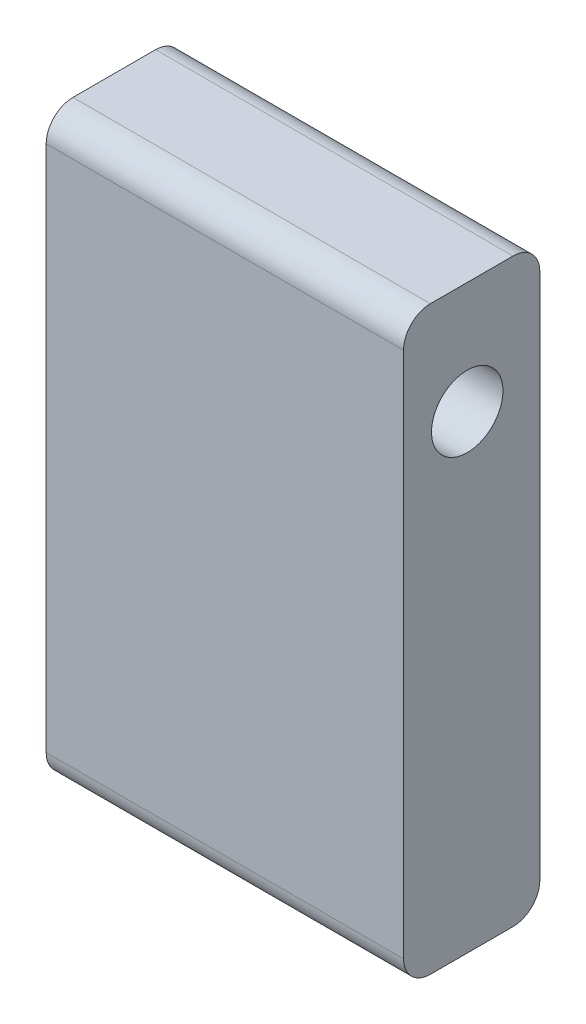
ISO-10303-21;
HEADER;
FILE_DESCRIPTION(('STEP AP214'),'2;1');
FILE_NAME('part.step','',(''),(''),'','','');
FILE_SCHEMA(('AUTOMOTIVE_DESIGN { 1 0 10303 214 1 1 1 1 }'));
ENDSEC;
DATA;
#1=APPLICATION_CONTEXT('core data for automotive mechanical design processes');
#2=APPLICATION_PROTOCOL_DEFINITION('international standard','automotive_design',2000,#1);
#3=PRODUCT_CONTEXT('',#1,'mechanical');
#4=PRODUCT('Part','Part','',(#3));
#5=PRODUCT_RELATED_PRODUCT_CATEGORY('part','',(#4));
#6=PRODUCT_DEFINITION_FORMATION('','',#4);
#7=PRODUCT_DEFINITION_CONTEXT('part definition',#1,'design');
#8=PRODUCT_DEFINITION('design','',#6,#7);
#9=PRODUCT_DEFINITION_SHAPE('','',#8);
#10=(LENGTH_UNIT() NAMED_UNIT(*) SI_UNIT(.MILLI.,.METRE.));
#11=(NAMED_UNIT(*) PLANE_ANGLE_UNIT() SI_UNIT($,.RADIAN.));
#12=(NAMED_UNIT(*) SI_UNIT($,.STERADIAN.) SOLID_ANGLE_UNIT());
#13=UNCERTAINTY_MEASURE_WITH_UNIT(LENGTH_MEASURE(1.E-05),#10,'distance_accuracy_value','');
#14=(GEOMETRIC_REPRESENTATION_CONTEXT(3) GLOBAL_UNCERTAINTY_ASSIGNED_CONTEXT((#13)) GLOBAL_UNIT_ASSIGNED_CONTEXT((#10,
#11,#12)) REPRESENTATION_CONTEXT('',''));
#15=CARTESIAN_POINT('',(0.,0.,0.));
#16=DIRECTION('',(0.,0.,1.));
#17=DIRECTION('',(1.,0.,0.));
#18=AXIS2_PLACEMENT_3D('',#15,#16,#17);
#19=CARTESIAN_POINT('',(-16.,16.,0.));
#20=DIRECTION('',(1.,0.,0.));
#21=DIRECTION('',(0.,0.,-1.));
#22=AXIS2_PLACEMENT_3D('',#19,#20,#21);
#23=CYLINDRICAL_SURFACE('',#22,2.8);
#24=CARTESIAN_POINT('',(-16.,16.,0.));
#25=DIRECTION('',(1.,0.,0.));
#26=DIRECTION('',(0.,0.,-1.));
#27=AXIS2_PLACEMENT_3D('',#24,#25,#26);
#28=CIRCLE('',#27,2.8);
#29=CARTESIAN_POINT('',(-16.,16.,-2.8));
#30=VERTEX_POINT('',#29);
#31=EDGE_CURVE('E170',#30,#30,#28,.T.);
#32=ORIENTED_EDGE('',*,*,#31,.F.);
#33=EDGE_LOOP('',(#32));
#34=FACE_BOUND('',#33,.T.);
#35=CARTESIAN_POINT('',(-5.,16.,0.));
#36=DIRECTION('',(1.,0.,0.));
#37=DIRECTION('',(0.,0.,-1.));
#38=AXIS2_PLACEMENT_3D('',#35,#36,#37);
#39=CIRCLE('',#38,2.8);
#40=CARTESIAN_POINT('',(-5.,16.,-2.8));
#41=VERTEX_POINT('',#40);
#42=EDGE_CURVE('E134',#41,#41,#39,.F.);
#43=ORIENTED_EDGE('',*,*,#42,.F.);
#44=EDGE_LOOP('',(#43));
#45=FACE_BOUND('',#44,.T.);
#46=ADVANCED_FACE('F41',(#34,#45),#23,.F.);
#47=CARTESIAN_POINT('',(-16.,-5.,0.));
#48=DIRECTION('',(0.,-1.,0.));
#49=DIRECTION('',(0.,0.,-1.));
#50=AXIS2_PLACEMENT_3D('',#47,#48,#49);
#51=PLANE('',#50);
#52=DIRECTION('',(0.,0.,-1.));
#53=VECTOR('',#52,1.);
#54=CARTESIAN_POINT('',(0.,-5.,0.));
#55=LINE('',#54,#53);
#56=CARTESIAN_POINT('',(0.,-5.,1.65));
#57=VERTEX_POINT('',#56);
#58=CARTESIAN_POINT('',(0.,-5.,-2.05));
#59=VERTEX_POINT('',#58);
#60=EDGE_CURVE('E175',#57,#59,#55,.T.);
#61=ORIENTED_EDGE('',*,*,#60,.F.);
#62=DIRECTION('',(1.,0.,0.));
#63=VECTOR('',#62,1.);
#64=CARTESIAN_POINT('',(-16.,-5.,1.65));
#65=LINE('',#64,#63);
#66=CARTESIAN_POINT('',(-16.,-5.,1.65));
#67=VERTEX_POINT('',#66);
#68=EDGE_CURVE('E112',#57,#67,#65,.F.);
#69=ORIENTED_EDGE('',*,*,#68,.T.);
#70=DIRECTION('',(0.,0.,-1.));
#71=VECTOR('',#70,1.);
#72=CARTESIAN_POINT('',(-16.,-5.,0.));
#73=LINE('',#72,#71);
#74=CARTESIAN_POINT('',(-16.,-5.,-2.05));
#75=VERTEX_POINT('',#74);
#76=EDGE_CURVE('E173',#67,#75,#73,.T.);
#77=ORIENTED_EDGE('',*,*,#76,.T.);
#78=DIRECTION('',(1.,0.,0.));
#79=VECTOR('',#78,1.);
#80=CARTESIAN_POINT('',(-16.,-5.,-2.05));
#81=LINE('',#80,#79);
#82=EDGE_CURVE('E117',#75,#59,#81,.T.);
#83=ORIENTED_EDGE('',*,*,#82,.T.);
#84=EDGE_LOOP('',(#61,#69,#77,#83));
#85=FACE_BOUND('',#84,.T.);
#86=ADVANCED_FACE('F206',(#85),#51,.T.);
#87=CARTESIAN_POINT('',(-16.,21.,0.));
#88=DIRECTION('',(0.,-1.,0.));
#89=DIRECTION('',(0.,0.,-1.));
#90=AXIS2_PLACEMENT_3D('',#87,#88,#89);
#91=PLANE('',#90);
#92=DIRECTION('',(0.,0.,-1.));
#93=VECTOR('',#92,1.);
#94=CARTESIAN_POINT('',(0.,21.,0.));
#95=LINE('',#94,#93);
#96=CARTESIAN_POINT('',(0.,21.,1.65));
#97=VERTEX_POINT('',#96);
#98=CARTESIAN_POINT('',(0.,21.,-2.05));
#99=VERTEX_POINT('',#98);
#100=EDGE_CURVE('E165',#97,#99,#95,.T.);
#101=ORIENTED_EDGE('',*,*,#100,.T.);
#102=DIRECTION('',(1.,0.,0.));
#103=VECTOR('',#102,1.);
#104=CARTESIAN_POINT('',(-16.,21.,-2.05));
#105=LINE('',#104,#103);
#106=CARTESIAN_POINT('',(-16.,21.,-2.05));
#107=VERTEX_POINT('',#106);
#108=EDGE_CURVE('E11',#99,#107,#105,.F.);
#109=ORIENTED_EDGE('',*,*,#108,.T.);
#110=DIRECTION('',(0.,0.,-1.));
#111=VECTOR('',#110,1.);
#112=CARTESIAN_POINT('',(-16.,21.,0.));
#113=LINE('',#112,#111);
#114=CARTESIAN_POINT('',(-16.,21.,1.65));
#115=VERTEX_POINT('',#114);
#116=EDGE_CURVE('E138',#115,#107,#113,.T.);
#117=ORIENTED_EDGE('',*,*,#116,.F.);
#118=DIRECTION('',(1.,0.,0.));
#119=VECTOR('',#118,1.);
#120=CARTESIAN_POINT('',(-16.,21.,1.65));
#121=LINE('',#120,#119);
#122=EDGE_CURVE('E49',#115,#97,#121,.T.);
#123=ORIENTED_EDGE('',*,*,#122,.T.);
#124=EDGE_LOOP('',(#101,#109,#117,#123));
#125=FACE_BOUND('',#124,.T.);
#126=ADVANCED_FACE('F164',(#125),#91,.F.);
#127=CARTESIAN_POINT('',(-16.,0.,-3.25));
#128=DIRECTION('',(0.,0.,-1.));
#129=DIRECTION('',(-1.,0.,0.));
#130=AXIS2_PLACEMENT_3D('',#127,#128,#129);
#131=PLANE('',#130);
#132=DIRECTION('',(0.,1.,0.));
#133=VECTOR('',#132,1.);
#134=CARTESIAN_POINT('',(0.,0.,-3.25));
#135=LINE('',#134,#133);
#136=CARTESIAN_POINT('',(0.,-3.8,-3.25));
#137=VERTEX_POINT('',#136);
#138=CARTESIAN_POINT('',(0.,19.8,-3.25));
#139=VERTEX_POINT('',#138);
#140=EDGE_CURVE('E171',#137,#139,#135,.T.);
#141=ORIENTED_EDGE('',*,*,#140,.F.);
#142=DIRECTION('',(1.,0.,0.));
#143=VECTOR('',#142,1.);
#144=CARTESIAN_POINT('',(-16.,-3.8,-3.25));
#145=LINE('',#144,#143);
#146=CARTESIAN_POINT('',(-16.,-3.8,-3.25));
#147=VERTEX_POINT('',#146);
#148=EDGE_CURVE('E63',#137,#147,#145,.F.);
#149=ORIENTED_EDGE('',*,*,#148,.T.);
#150=DIRECTION('',(0.,1.,0.));
#151=VECTOR('',#150,1.);
#152=CARTESIAN_POINT('',(-16.,0.,-3.25));
#153=LINE('',#152,#151);
#154=CARTESIAN_POINT('',(-16.,19.8,-3.25));
#155=VERTEX_POINT('',#154);
#156=EDGE_CURVE('E181',#147,#155,#153,.T.);
#157=ORIENTED_EDGE('',*,*,#156,.T.);
#158=DIRECTION('',(1.,0.,0.));
#159=VECTOR('',#158,1.);
#160=CARTESIAN_POINT('',(0.,19.8,-3.25));
#161=LINE('',#160,#159);
#162=EDGE_CURVE('E156',#155,#139,#161,.T.);
#163=ORIENTED_EDGE('',*,*,#162,.T.);
#164=EDGE_LOOP('',(#141,#149,#157,#163));
#165=FACE_BOUND('',#164,.T.);
#166=ADVANCED_FACE('F227',(#165),#131,.T.);
#167=CARTESIAN_POINT('',(-16.,0.,0.));
#168=DIRECTION('',(1.,0.,0.));
#169=DIRECTION('',(0.,0.,-1.));
#170=AXIS2_PLACEMENT_3D('',#167,#168,#169);
#171=PLANE('',#170);
#172=CARTESIAN_POINT('',(-16.,5.,0.));
#173=DIRECTION('',(1.,0.,0.));
#174=DIRECTION('',(0.,0.,-1.));
#175=AXIS2_PLACEMENT_3D('',#172,#173,#174);
#176=CIRCLE('',#175,2.55);
#177=CARTESIAN_POINT('',(-16.,5.,-2.55));
#178=VERTEX_POINT('',#177);
#179=EDGE_CURVE('E191',#178,#178,#176,.T.);
#180=ORIENTED_EDGE('',*,*,#179,.T.);
#181=EDGE_LOOP('',(#180));
#182=FACE_BOUND('',#181,.T.);
#183=ORIENTED_EDGE('',*,*,#31,.T.);
#184=EDGE_LOOP('',(#183));
#185=FACE_BOUND('',#184,.T.);
#186=ORIENTED_EDGE('',*,*,#76,.F.);
#187=CARTESIAN_POINT('',(-16.,-3.8,1.65));
#188=DIRECTION('',(1.,0.,0.));
#189=DIRECTION('',(0.,0.,-1.));
#190=AXIS2_PLACEMENT_3D('',#187,#188,#189);
#191=CIRCLE('',#190,1.2);
#192=CARTESIAN_POINT('',(-16.,-3.8,2.85));
#193=VERTEX_POINT('',#192);
#194=EDGE_CURVE('E154',#67,#193,#191,.F.);
#195=ORIENTED_EDGE('',*,*,#194,.T.);
#196=DIRECTION('',(0.,1.,0.));
#197=VECTOR('',#196,1.);
#198=CARTESIAN_POINT('',(-16.,0.,2.85));
#199=LINE('',#198,#197);
#200=CARTESIAN_POINT('',(-16.,19.8,2.85));
#201=VERTEX_POINT('',#200);
#202=EDGE_CURVE('E127',#193,#201,#199,.T.);
#203=ORIENTED_EDGE('',*,*,#202,.T.);
#204=CARTESIAN_POINT('',(-16.,19.8,1.65));
#205=DIRECTION('',(1.,0.,0.));
#206=DIRECTION('',(0.,0.,-1.));
#207=AXIS2_PLACEMENT_3D('',#204,#205,#206);
#208=CIRCLE('',#207,1.2);
#209=EDGE_CURVE('E149',#201,#115,#208,.F.);
#210=ORIENTED_EDGE('',*,*,#209,.T.);
#211=ORIENTED_EDGE('',*,*,#116,.T.);
#212=CARTESIAN_POINT('',(-16.,19.8,-2.05));
#213=DIRECTION('',(1.,0.,0.));
#214=DIRECTION('',(0.,0.,-1.));
#215=AXIS2_PLACEMENT_3D('',#212,#213,#214);
#216=CIRCLE('',#215,1.2);
#217=EDGE_CURVE('E56',#107,#155,#216,.F.);
#218=ORIENTED_EDGE('',*,*,#217,.T.);
#219=ORIENTED_EDGE('',*,*,#156,.F.);
#220=CARTESIAN_POINT('',(-16.,-3.8,-2.05));
#221=DIRECTION('',(1.,0.,0.));
#222=DIRECTION('',(0.,0.,-1.));
#223=AXIS2_PLACEMENT_3D('',#220,#221,#222);
#224=CIRCLE('',#223,1.2);
#225=EDGE_CURVE('E152',#147,#75,#224,.F.);
#226=ORIENTED_EDGE('',*,*,#225,.T.);
#227=EDGE_LOOP('',(#186,#195,#203,#210,#211,#218,#219,#226));
#228=FACE_BOUND('',#227,.T.);
#229=ADVANCED_FACE('F197',(#182,#185,#228),#171,.F.);
#230=CARTESIAN_POINT('',(0.,0.,0.));
#231=DIRECTION('',(1.,0.,0.));
#232=DIRECTION('',(0.,0.,-1.));
#233=AXIS2_PLACEMENT_3D('',#230,#231,#232);
#234=PLANE('',#233);
#235=DIRECTION('',(0.,1.,0.));
#236=VECTOR('',#235,1.);
#237=CARTESIAN_POINT('',(0.,0.,2.85));
#238=LINE('',#237,#236);
#239=CARTESIAN_POINT('',(0.,-3.8,2.85));
#240=VERTEX_POINT('',#239);
#241=CARTESIAN_POINT('',(0.,19.8,2.85));
#242=VERTEX_POINT('',#241);
#243=EDGE_CURVE('E124',#240,#242,#238,.T.);
#244=ORIENTED_EDGE('',*,*,#243,.F.);
#245=CARTESIAN_POINT('',(0.,-3.8,1.65));
#246=DIRECTION('',(1.,0.,0.));
#247=DIRECTION('',(0.,0.,-1.));
#248=AXIS2_PLACEMENT_3D('',#245,#246,#247);
#249=CIRCLE('',#248,1.2);
#250=EDGE_CURVE('E107',#240,#57,#249,.T.);
#251=ORIENTED_EDGE('',*,*,#250,.T.);
#252=ORIENTED_EDGE('',*,*,#60,.T.);
#253=CARTESIAN_POINT('',(0.,-3.8,-2.05));
#254=DIRECTION('',(1.,0.,0.));
#255=DIRECTION('',(0.,0.,-1.));
#256=AXIS2_PLACEMENT_3D('',#253,#254,#255);
#257=CIRCLE('',#256,1.2);
#258=EDGE_CURVE('E118',#59,#137,#257,.T.);
#259=ORIENTED_EDGE('',*,*,#258,.T.);
#260=ORIENTED_EDGE('',*,*,#140,.T.);
#261=CARTESIAN_POINT('',(0.,19.8,-2.05));
#262=DIRECTION('',(1.,0.,0.));
#263=DIRECTION('',(0.,0.,-1.));
#264=AXIS2_PLACEMENT_3D('',#261,#262,#263);
#265=CIRCLE('',#264,1.2);
#266=EDGE_CURVE('E143',#139,#99,#265,.T.);
#267=ORIENTED_EDGE('',*,*,#266,.T.);
#268=ORIENTED_EDGE('',*,*,#100,.F.);
#269=CARTESIAN_POINT('',(0.,19.8,1.65));
#270=DIRECTION('',(1.,0.,0.));
#271=DIRECTION('',(0.,0.,-1.));
#272=AXIS2_PLACEMENT_3D('',#269,#270,#271);
#273=CIRCLE('',#272,1.2);
#274=EDGE_CURVE('E128',#97,#242,#273,.T.);
#275=ORIENTED_EDGE('',*,*,#274,.T.);
#276=EDGE_LOOP('',(#244,#251,#252,#259,#260,#267,#268,#275));
#277=FACE_BOUND('',#276,.T.);
#278=CARTESIAN_POINT('',(0.,16.,0.));
#279=DIRECTION('',(1.,0.,0.));
#280=DIRECTION('',(0.,0.,-1.));
#281=AXIS2_PLACEMENT_3D('',#278,#279,#280);
#282=CIRCLE('',#281,1.6);
#283=CARTESIAN_POINT('',(0.,16.,-1.6));
#284=VERTEX_POINT('',#283);
#285=EDGE_CURVE('E185',#284,#284,#282,.T.);
#286=ORIENTED_EDGE('',*,*,#285,.F.);
#287=EDGE_LOOP('',(#286));
#288=FACE_BOUND('',#287,.T.);
#289=ADVANCED_FACE('F131',(#277,#288),#234,.T.);
#290=CARTESIAN_POINT('',(-5.,16.,0.));
#291=DIRECTION('',(1.,0.,0.));
#292=DIRECTION('',(0.,0.,-1.));
#293=AXIS2_PLACEMENT_3D('',#290,#291,#292);
#294=CYLINDRICAL_SURFACE('',#293,1.6);
#295=CARTESIAN_POINT('',(-5.,16.,0.));
#296=DIRECTION('',(1.,0.,0.));
#297=DIRECTION('',(0.,0.,-1.));
#298=AXIS2_PLACEMENT_3D('',#295,#296,#297);
#299=CIRCLE('',#298,1.6);
#300=CARTESIAN_POINT('',(-5.,16.,-1.6));
#301=VERTEX_POINT('',#300);
#302=EDGE_CURVE('E179',#301,#301,#299,.T.);
#303=ORIENTED_EDGE('',*,*,#302,.F.);
#304=EDGE_LOOP('',(#303));
#305=FACE_BOUND('',#304,.T.);
#306=ORIENTED_EDGE('',*,*,#285,.T.);
#307=EDGE_LOOP('',(#306));
#308=FACE_BOUND('',#307,.T.);
#309=ADVANCED_FACE('F239',(#305,#308),#294,.F.);
#310=CARTESIAN_POINT('',(-5.,0.,0.));
#311=DIRECTION('',(1.,0.,0.));
#312=DIRECTION('',(0.,0.,-1.));
#313=AXIS2_PLACEMENT_3D('',#310,#311,#312);
#314=PLANE('',#313);
#315=ORIENTED_EDGE('',*,*,#302,.T.);
#316=EDGE_LOOP('',(#315));
#317=FACE_BOUND('',#316,.T.);
#318=ORIENTED_EDGE('',*,*,#42,.T.);
#319=EDGE_LOOP('',(#318));
#320=FACE_BOUND('',#319,.T.);
#321=ADVANCED_FACE('F242',(#317,#320),#314,.F.);
#322=CARTESIAN_POINT('',(-7.6,5.,0.));
#323=DIRECTION('',(-1.,0.,0.));
#324=DIRECTION('',(0.,0.,1.));
#325=AXIS2_PLACEMENT_3D('',#322,#323,#324);
#326=CYLINDRICAL_SURFACE('',#325,2.55);
#327=CARTESIAN_POINT('',(-7.6,5.,0.));
#328=DIRECTION('',(1.,0.,0.));
#329=DIRECTION('',(0.,0.,-1.));
#330=AXIS2_PLACEMENT_3D('',#327,#328,#329);
#331=CIRCLE('',#330,2.55);
#332=CARTESIAN_POINT('',(-7.6,5.,-2.55));
#333=VERTEX_POINT('',#332);
#334=EDGE_CURVE('E188',#333,#333,#331,.T.);
#335=ORIENTED_EDGE('',*,*,#334,.T.);
#336=EDGE_LOOP('',(#335));
#337=FACE_BOUND('',#336,.T.);
#338=ORIENTED_EDGE('',*,*,#179,.F.);
#339=EDGE_LOOP('',(#338));
#340=FACE_BOUND('',#339,.T.);
#341=ADVANCED_FACE('F246',(#337,#340),#326,.F.);
#342=CARTESIAN_POINT('',(-7.6,5.,0.));
#343=DIRECTION('',(1.,0.,0.));
#344=DIRECTION('',(0.,0.,-1.));
#345=AXIS2_PLACEMENT_3D('',#342,#343,#344);
#346=PLANE('',#345);
#347=ORIENTED_EDGE('',*,*,#334,.F.);
#348=EDGE_LOOP('',(#347));
#349=FACE_BOUND('',#348,.T.);
#350=ADVANCED_FACE('F250',(#349),#346,.F.);
#351=CARTESIAN_POINT('',(0.,0.,2.85));
#352=DIRECTION('',(0.,0.,-1.));
#353=DIRECTION('',(-1.,0.,0.));
#354=AXIS2_PLACEMENT_3D('',#351,#352,#353);
#355=PLANE('',#354);
#356=ORIENTED_EDGE('',*,*,#202,.F.);
#357=DIRECTION('',(1.,0.,0.));
#358=VECTOR('',#357,1.);
#359=CARTESIAN_POINT('',(0.,-3.8,2.85));
#360=LINE('',#359,#358);
#361=EDGE_CURVE('E111',#193,#240,#360,.T.);
#362=ORIENTED_EDGE('',*,*,#361,.T.);
#363=ORIENTED_EDGE('',*,*,#243,.T.);
#364=DIRECTION('',(1.,0.,0.));
#365=VECTOR('',#364,1.);
#366=CARTESIAN_POINT('',(0.,19.8,2.85));
#367=LINE('',#366,#365);
#368=EDGE_CURVE('E129',#242,#201,#367,.F.);
#369=ORIENTED_EDGE('',*,*,#368,.T.);
#370=EDGE_LOOP('',(#356,#362,#363,#369));
#371=FACE_BOUND('',#370,.T.);
#372=ADVANCED_FACE('F123',(#371),#355,.F.);
#373=CARTESIAN_POINT('',(0.,-3.8,1.65));
#374=DIRECTION('',(-1.,0.,0.));
#375=DIRECTION('',(0.,0.,1.));
#376=AXIS2_PLACEMENT_3D('',#373,#374,#375);
#377=CYLINDRICAL_SURFACE('',#376,1.2);
#378=ORIENTED_EDGE('',*,*,#194,.F.);
#379=ORIENTED_EDGE('',*,*,#68,.F.);
#380=ORIENTED_EDGE('',*,*,#250,.F.);
#381=ORIENTED_EDGE('',*,*,#361,.F.);
#382=EDGE_LOOP('',(#378,#379,#380,#381));
#383=FACE_BOUND('',#382,.T.);
#384=ADVANCED_FACE('F110',(#383),#377,.T.);
#385=CARTESIAN_POINT('',(-16.,-3.8,-2.05));
#386=DIRECTION('',(1.,0.,0.));
#387=DIRECTION('',(0.,0.,-1.));
#388=AXIS2_PLACEMENT_3D('',#385,#386,#387);
#389=CYLINDRICAL_SURFACE('',#388,1.2);
#390=ORIENTED_EDGE('',*,*,#225,.F.);
#391=ORIENTED_EDGE('',*,*,#148,.F.);
#392=ORIENTED_EDGE('',*,*,#258,.F.);
#393=ORIENTED_EDGE('',*,*,#82,.F.);
#394=EDGE_LOOP('',(#390,#391,#392,#393));
#395=FACE_BOUND('',#394,.T.);
#396=ADVANCED_FACE('F203',(#395),#389,.T.);
#397=CARTESIAN_POINT('',(-16.,19.8,-2.05));
#398=DIRECTION('',(-1.,0.,0.));
#399=DIRECTION('',(0.,0.,1.));
#400=AXIS2_PLACEMENT_3D('',#397,#398,#399);
#401=CYLINDRICAL_SURFACE('',#400,1.2);
#402=ORIENTED_EDGE('',*,*,#217,.F.);
#403=ORIENTED_EDGE('',*,*,#108,.F.);
#404=ORIENTED_EDGE('',*,*,#266,.F.);
#405=ORIENTED_EDGE('',*,*,#162,.F.);
#406=EDGE_LOOP('',(#402,#403,#404,#405));
#407=FACE_BOUND('',#406,.T.);
#408=ADVANCED_FACE('F199',(#407),#401,.T.);
#409=CARTESIAN_POINT('',(-16.,19.8,1.65));
#410=DIRECTION('',(1.,0.,0.));
#411=DIRECTION('',(0.,0.,-1.));
#412=AXIS2_PLACEMENT_3D('',#409,#410,#411);
#413=CYLINDRICAL_SURFACE('',#412,1.2);
#414=ORIENTED_EDGE('',*,*,#209,.F.);
#415=ORIENTED_EDGE('',*,*,#368,.F.);
#416=ORIENTED_EDGE('',*,*,#274,.F.);
#417=ORIENTED_EDGE('',*,*,#122,.F.);
#418=EDGE_LOOP('',(#414,#415,#416,#417));
#419=FACE_BOUND('',#418,.T.);
#420=ADVANCED_FACE('F43',(#419),#413,.T.);
#421=CLOSED_SHELL('',(#46,#86,#126,#166,#229,#289,#309,#321,#341,#350,#372,#384,#396,#408,#420));
#422=MANIFOLD_SOLID_BREP('B2',#421);
#423=ADVANCED_BREP_SHAPE_REPRESENTATION('',(#18,#422),#14);
#424=SHAPE_DEFINITION_REPRESENTATION(#9,#423);
ENDSEC;
END-ISO-10303-21;
